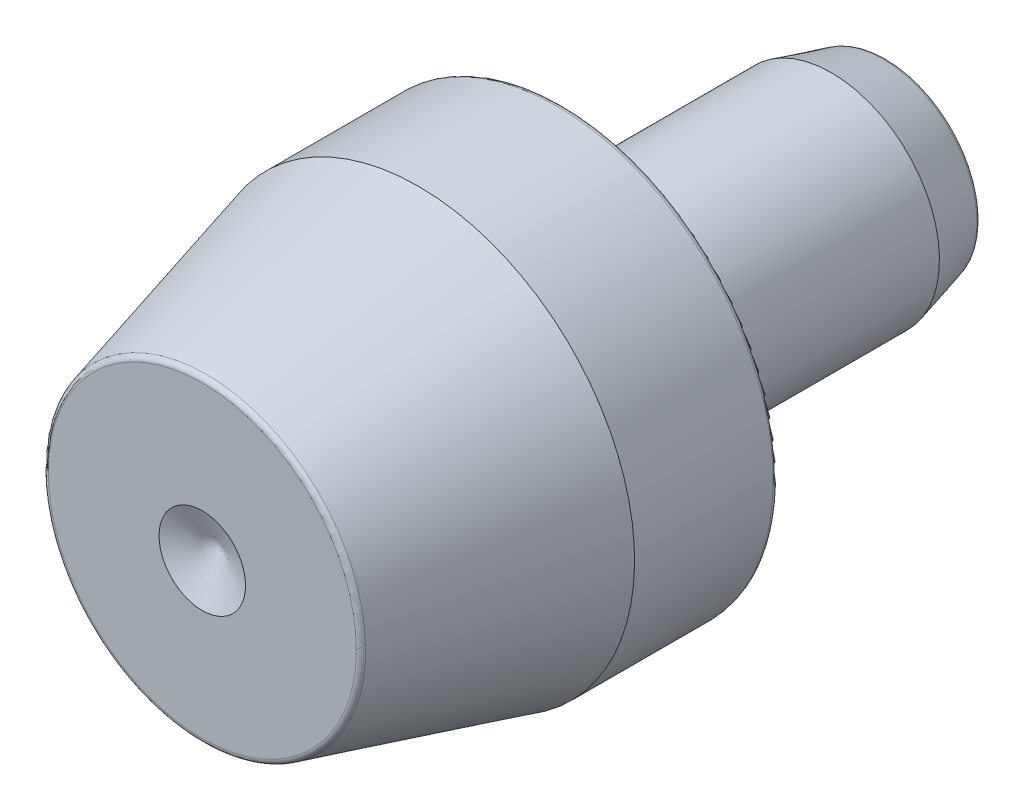
ISO-10303-21;
HEADER;
FILE_DESCRIPTION(('STEP AP214'),'2;1');
FILE_NAME('part.step','',(''),(''),'','','');
FILE_SCHEMA(('AUTOMOTIVE_DESIGN { 1 0 10303 214 1 1 1 1 }'));
ENDSEC;
DATA;
#1=APPLICATION_CONTEXT('core data for automotive mechanical design processes');
#2=APPLICATION_PROTOCOL_DEFINITION('international standard','automotive_design',2000,#1);
#3=PRODUCT_CONTEXT('',#1,'mechanical');
#4=PRODUCT('Part','Part','',(#3));
#5=PRODUCT_RELATED_PRODUCT_CATEGORY('part','',(#4));
#6=PRODUCT_DEFINITION_FORMATION('','',#4);
#7=PRODUCT_DEFINITION_CONTEXT('part definition',#1,'design');
#8=PRODUCT_DEFINITION('design','',#6,#7);
#9=PRODUCT_DEFINITION_SHAPE('','',#8);
#10=(LENGTH_UNIT() NAMED_UNIT(*) SI_UNIT(.MILLI.,.METRE.));
#11=(NAMED_UNIT(*) PLANE_ANGLE_UNIT() SI_UNIT($,.RADIAN.));
#12=(NAMED_UNIT(*) SI_UNIT($,.STERADIAN.) SOLID_ANGLE_UNIT());
#13=UNCERTAINTY_MEASURE_WITH_UNIT(LENGTH_MEASURE(1.E-05),#10,'distance_accuracy_value','');
#14=(GEOMETRIC_REPRESENTATION_CONTEXT(3) GLOBAL_UNCERTAINTY_ASSIGNED_CONTEXT((#13)) GLOBAL_UNIT_ASSIGNED_CONTEXT((#10,
#11,#12)) REPRESENTATION_CONTEXT('',''));
#15=CARTESIAN_POINT('',(0.,0.,0.));
#16=DIRECTION('',(0.,0.,1.));
#17=DIRECTION('',(1.,0.,0.));
#18=AXIS2_PLACEMENT_3D('',#15,#16,#17);
#19=CARTESIAN_POINT('',(0.,0.,9.5));
#20=DIRECTION('',(0.,0.,1.));
#21=DIRECTION('',(0.,-1.,0.));
#22=AXIS2_PLACEMENT_3D('',#19,#20,#21);
#23=CONICAL_SURFACE('',#22,1.2,1.17809724509618);
#24=CARTESIAN_POINT('',(0.,0.,9.0029437251523));
#25=VERTEX_POINT('',#24);
#26=VERTEX_LOOP('',#25);
#27=FACE_BOUND('',#26,.T.);
#28=CARTESIAN_POINT('',(0.,0.,9.5));
#29=DIRECTION('',(0.,0.,-1.));
#30=DIRECTION('',(0.,1.,0.));
#31=AXIS2_PLACEMENT_3D('',#28,#29,#30);
#32=CIRCLE('',#31,1.2);
#33=CARTESIAN_POINT('',(0.,1.2,9.5));
#34=VERTEX_POINT('',#33);
#35=EDGE_CURVE('E12',#34,#34,#32,.T.);
#36=ORIENTED_EDGE('',*,*,#35,.F.);
#37=EDGE_LOOP('',(#36));
#38=FACE_BOUND('',#37,.T.);
#39=ADVANCED_FACE('F184',(#27,#38),#23,.F.);
#40=CARTESIAN_POINT('',(0.,1.2,9.5));
#41=DIRECTION('',(0.,0.,1.));
#42=DIRECTION('',(0.,-1.,0.));
#43=AXIS2_PLACEMENT_3D('',#40,#41,#42);
#44=PLANE('',#43);
#45=ORIENTED_EDGE('',*,*,#35,.T.);
#46=EDGE_LOOP('',(#45));
#47=FACE_BOUND('',#46,.T.);
#48=CARTESIAN_POINT('',(0.,0.,9.5));
#49=DIRECTION('',(0.,0.,-1.));
#50=DIRECTION('',(0.,1.,0.));
#51=AXIS2_PLACEMENT_3D('',#48,#49,#50);
#52=CIRCLE('',#51,4.27432832101149);
#53=CARTESIAN_POINT('',(0.,4.27432832101149,9.5));
#54=VERTEX_POINT('',#53);
#55=EDGE_CURVE('E190',#54,#54,#52,.T.);
#56=ORIENTED_EDGE('',*,*,#55,.F.);
#57=EDGE_LOOP('',(#56));
#58=FACE_BOUND('',#57,.T.);
#59=ADVANCED_FACE('F195',(#47,#58),#44,.T.);
#60=CARTESIAN_POINT('',(0.,0.,9.34625));
#61=DIRECTION('',(0.,0.,-1.));
#62=DIRECTION('',(0.,1.,0.));
#63=AXIS2_PLACEMENT_3D('',#60,#61,#62);
#64=TOROIDAL_SURFACE('',#63,4.27432832101149,0.153750000000001);
#65=ORIENTED_EDGE('',*,*,#55,.T.);
#66=EDGE_LOOP('',(#65));
#67=FACE_BOUND('',#66,.T.);
#68=CARTESIAN_POINT('',(0.,0.,9.38604342818451));
#69=DIRECTION('',(0.,0.,-1.));
#70=DIRECTION('',(0.,1.,0.));
#71=AXIS2_PLACEMENT_3D('',#68,#69,#70);
#72=CIRCLE('',#71,4.42283941680344);
#73=CARTESIAN_POINT('',(0.,4.42283941680344,9.38604342818451));
#74=VERTEX_POINT('',#73);
#75=EDGE_CURVE('E204',#74,#74,#72,.T.);
#76=ORIENTED_EDGE('',*,*,#75,.F.);
#77=EDGE_LOOP('',(#76));
#78=FACE_BOUND('',#77,.T.);
#79=ADVANCED_FACE('F200',(#67,#78),#64,.T.);
#80=CARTESIAN_POINT('',(0.,0.,3.5));
#81=DIRECTION('',(0.,0.,-1.));
#82=DIRECTION('',(0.,1.,0.));
#83=AXIS2_PLACEMENT_3D('',#80,#81,#82);
#84=CONICAL_SURFACE('',#83,6.,0.26179938779915);
#85=ORIENTED_EDGE('',*,*,#75,.T.);
#86=EDGE_LOOP('',(#85));
#87=FACE_BOUND('',#86,.T.);
#88=CARTESIAN_POINT('',(0.,0.,3.5));
#89=DIRECTION('',(0.,0.,-1.));
#90=DIRECTION('',(0.,1.,0.));
#91=AXIS2_PLACEMENT_3D('',#88,#89,#90);
#92=CIRCLE('',#91,6.);
#93=CARTESIAN_POINT('',(0.,6.,3.5));
#94=VERTEX_POINT('',#93);
#95=EDGE_CURVE('E206',#94,#94,#92,.T.);
#96=ORIENTED_EDGE('',*,*,#95,.F.);
#97=EDGE_LOOP('',(#96));
#98=FACE_BOUND('',#97,.T.);
#99=ADVANCED_FACE('F295',(#87,#98),#84,.T.);
#100=CARTESIAN_POINT('',(0.,0.,-9.5));
#101=DIRECTION('',(0.,0.,-1.));
#102=DIRECTION('',(0.,1.,0.));
#103=AXIS2_PLACEMENT_3D('',#100,#101,#102);
#104=CYLINDRICAL_SURFACE('',#103,6.);
#105=ORIENTED_EDGE('',*,*,#95,.T.);
#106=EDGE_LOOP('',(#105));
#107=FACE_BOUND('',#106,.T.);
#108=CARTESIAN_POINT('',(0.,0.,-0.346250000000001));
#109=DIRECTION('',(0.,0.,-1.));
#110=DIRECTION('',(0.,1.,0.));
#111=AXIS2_PLACEMENT_3D('',#108,#109,#110);
#112=CIRCLE('',#111,6.);
#113=CARTESIAN_POINT('',(0.,6.,-0.346250000000001));
#114=VERTEX_POINT('',#113);
#115=EDGE_CURVE('E211',#114,#114,#112,.T.);
#116=ORIENTED_EDGE('',*,*,#115,.F.);
#117=EDGE_LOOP('',(#116));
#118=FACE_BOUND('',#117,.T.);
#119=ADVANCED_FACE('F291',(#107,#118),#104,.T.);
#120=CARTESIAN_POINT('',(0.,0.,-0.34625));
#121=DIRECTION('',(0.,0.,-1.));
#122=DIRECTION('',(0.,1.,0.));
#123=AXIS2_PLACEMENT_3D('',#120,#121,#122);
#124=TOROIDAL_SURFACE('',#123,5.84625,0.15375);
#125=ORIENTED_EDGE('',*,*,#115,.T.);
#126=EDGE_LOOP('',(#125));
#127=FACE_BOUND('',#126,.T.);
#128=CARTESIAN_POINT('',(0.,0.,-0.5));
#129=DIRECTION('',(0.,0.,-1.));
#130=DIRECTION('',(0.,1.,0.));
#131=AXIS2_PLACEMENT_3D('',#128,#129,#130);
#132=CIRCLE('',#131,5.84625);
#133=CARTESIAN_POINT('',(0.,5.84625,-0.5));
#134=VERTEX_POINT('',#133);
#135=EDGE_CURVE('E214',#134,#134,#132,.T.);
#136=ORIENTED_EDGE('',*,*,#135,.F.);
#137=EDGE_LOOP('',(#136));
#138=FACE_BOUND('',#137,.T.);
#139=ADVANCED_FACE('F287',(#127,#138),#124,.T.);
#140=CARTESIAN_POINT('',(0.,5.84625,-0.5));
#141=DIRECTION('',(0.,0.,-1.));
#142=DIRECTION('',(0.,1.,0.));
#143=AXIS2_PLACEMENT_3D('',#140,#141,#142);
#144=PLANE('',#143);
#145=ORIENTED_EDGE('',*,*,#135,.T.);
#146=EDGE_LOOP('',(#145));
#147=FACE_BOUND('',#146,.T.);
#148=CARTESIAN_POINT('',(0.,0.,-0.5));
#149=DIRECTION('',(0.,0.,-1.));
#150=DIRECTION('',(0.,1.,0.));
#151=AXIS2_PLACEMENT_3D('',#148,#149,#150);
#152=CIRCLE('',#151,3.46125);
#153=CARTESIAN_POINT('',(0.,3.46125,-0.5));
#154=VERTEX_POINT('',#153);
#155=EDGE_CURVE('E217',#154,#154,#152,.T.);
#156=ORIENTED_EDGE('',*,*,#155,.F.);
#157=EDGE_LOOP('',(#156));
#158=FACE_BOUND('',#157,.T.);
#159=ADVANCED_FACE('F283',(#147,#158),#144,.T.);
#160=CARTESIAN_POINT('',(0.,0.,-0.5));
#161=DIRECTION('',(0.,0.,-1.));
#162=DIRECTION('',(0.,1.,0.));
#163=AXIS2_PLACEMENT_3D('',#160,#161,#162);
#164=TOROIDAL_SURFACE('',#163,3.3075,0.153750000000001);
#165=ORIENTED_EDGE('',*,*,#155,.T.);
#166=EDGE_LOOP('',(#165));
#167=FACE_BOUND('',#166,.T.);
#168=CARTESIAN_POINT('',(0.,0.,-0.346250000000001));
#169=DIRECTION('',(0.,0.,-1.));
#170=DIRECTION('',(0.,1.,0.));
#171=AXIS2_PLACEMENT_3D('',#168,#169,#170);
#172=CIRCLE('',#171,3.3075);
#173=CARTESIAN_POINT('',(0.,3.3075,-0.346250000000001));
#174=VERTEX_POINT('',#173);
#175=EDGE_CURVE('E220',#174,#174,#172,.T.);
#176=ORIENTED_EDGE('',*,*,#175,.F.);
#177=EDGE_LOOP('',(#176));
#178=FACE_BOUND('',#177,.T.);
#179=ADVANCED_FACE('F279',(#167,#178),#164,.F.);
#180=CARTESIAN_POINT('',(0.,3.3075,-0.346250000000001));
#181=DIRECTION('',(0.,0.,-1.));
#182=DIRECTION('',(0.,1.,0.));
#183=AXIS2_PLACEMENT_3D('',#180,#181,#182);
#184=PLANE('',#183);
#185=ORIENTED_EDGE('',*,*,#175,.T.);
#186=EDGE_LOOP('',(#185));
#187=FACE_BOUND('',#186,.T.);
#188=CARTESIAN_POINT('',(0.,0.,-0.346250000000001));
#189=DIRECTION('',(0.,0.,-1.));
#190=DIRECTION('',(0.,1.,0.));
#191=AXIS2_PLACEMENT_3D('',#188,#189,#190);
#192=CIRCLE('',#191,3.);
#193=CARTESIAN_POINT('',(0.,3.,-0.346250000000001));
#194=VERTEX_POINT('',#193);
#195=EDGE_CURVE('E223',#194,#194,#192,.T.);
#196=ORIENTED_EDGE('',*,*,#195,.F.);
#197=EDGE_LOOP('',(#196));
#198=FACE_BOUND('',#197,.T.);
#199=ADVANCED_FACE('F275',(#187,#198),#184,.T.);
#200=CARTESIAN_POINT('',(0.,0.,-0.500000000000001));
#201=DIRECTION('',(0.,0.,-1.));
#202=DIRECTION('',(0.,1.,0.));
#203=AXIS2_PLACEMENT_3D('',#200,#201,#202);
#204=TOROIDAL_SURFACE('',#203,3.,0.15375);
#205=ORIENTED_EDGE('',*,*,#195,.T.);
#206=EDGE_LOOP('',(#205));
#207=FACE_BOUND('',#206,.T.);
#208=CARTESIAN_POINT('',(0.,0.,-0.5));
#209=DIRECTION('',(0.,0.,-1.));
#210=DIRECTION('',(0.,1.,0.));
#211=AXIS2_PLACEMENT_3D('',#208,#209,#210);
#212=CIRCLE('',#211,2.84625);
#213=CARTESIAN_POINT('',(0.,2.84625,-0.5));
#214=VERTEX_POINT('',#213);
#215=EDGE_CURVE('E226',#214,#214,#212,.T.);
#216=ORIENTED_EDGE('',*,*,#215,.F.);
#217=EDGE_LOOP('',(#216));
#218=FACE_BOUND('',#217,.T.);
#219=ADVANCED_FACE('F271',(#207,#218),#204,.F.);
#220=CARTESIAN_POINT('',(0.,0.,-9.5));
#221=DIRECTION('',(0.,0.,-1.));
#222=DIRECTION('',(0.,1.,0.));
#223=AXIS2_PLACEMENT_3D('',#220,#221,#222);
#224=CYLINDRICAL_SURFACE('',#223,2.84625);
#225=ORIENTED_EDGE('',*,*,#215,.T.);
#226=EDGE_LOOP('',(#225));
#227=FACE_BOUND('',#226,.T.);
#228=CARTESIAN_POINT('',(0.,0.,-1.26875));
#229=DIRECTION('',(0.,0.,-1.));
#230=DIRECTION('',(0.,1.,0.));
#231=AXIS2_PLACEMENT_3D('',#228,#229,#230);
#232=CIRCLE('',#231,2.84625);
#233=CARTESIAN_POINT('',(0.,2.84625,-1.26875));
#234=VERTEX_POINT('',#233);
#235=EDGE_CURVE('E229',#234,#234,#232,.T.);
#236=ORIENTED_EDGE('',*,*,#235,.F.);
#237=EDGE_LOOP('',(#236));
#238=FACE_BOUND('',#237,.T.);
#239=ADVANCED_FACE('F267',(#227,#238),#224,.T.);
#240=CARTESIAN_POINT('',(0.,0.,-1.4225));
#241=DIRECTION('',(0.,0.,-1.));
#242=DIRECTION('',(0.,1.,0.));
#243=AXIS2_PLACEMENT_3D('',#240,#241,#242);
#244=CONICAL_SURFACE('',#243,3.,0.785398163397454);
#245=ORIENTED_EDGE('',*,*,#235,.T.);
#246=EDGE_LOOP('',(#245));
#247=FACE_BOUND('',#246,.T.);
#248=CARTESIAN_POINT('',(0.,0.,-1.4225));
#249=DIRECTION('',(0.,0.,-1.));
#250=DIRECTION('',(0.,1.,0.));
#251=AXIS2_PLACEMENT_3D('',#248,#249,#250);
#252=CIRCLE('',#251,3.);
#253=CARTESIAN_POINT('',(0.,3.,-1.4225));
#254=VERTEX_POINT('',#253);
#255=EDGE_CURVE('E232',#254,#254,#252,.T.);
#256=ORIENTED_EDGE('',*,*,#255,.F.);
#257=EDGE_LOOP('',(#256));
#258=FACE_BOUND('',#257,.T.);
#259=ADVANCED_FACE('F263',(#247,#258),#244,.T.);
#260=CARTESIAN_POINT('',(0.,0.,-9.5));
#261=DIRECTION('',(0.,0.,-1.));
#262=DIRECTION('',(0.,1.,0.));
#263=AXIS2_PLACEMENT_3D('',#260,#261,#262);
#264=CYLINDRICAL_SURFACE('',#263,3.);
#265=ORIENTED_EDGE('',*,*,#255,.T.);
#266=EDGE_LOOP('',(#265));
#267=FACE_BOUND('',#266,.T.);
#268=CARTESIAN_POINT('',(0.,0.,-7.9625));
#269=DIRECTION('',(0.,0.,-1.));
#270=DIRECTION('',(0.,1.,0.));
#271=AXIS2_PLACEMENT_3D('',#268,#269,#270);
#272=CIRCLE('',#271,3.);
#273=CARTESIAN_POINT('',(0.,3.,-7.9625));
#274=VERTEX_POINT('',#273);
#275=EDGE_CURVE('E235',#274,#274,#272,.T.);
#276=ORIENTED_EDGE('',*,*,#275,.F.);
#277=EDGE_LOOP('',(#276));
#278=FACE_BOUND('',#277,.T.);
#279=ADVANCED_FACE('F257',(#267,#278),#264,.T.);
#280=CARTESIAN_POINT('',(0.,0.,-9.38604342818451));
#281=DIRECTION('',(0.,0.,1.));
#282=DIRECTION('',(0.,-1.,0.));
#283=AXIS2_PLACEMENT_3D('',#280,#281,#282);
#284=CONICAL_SURFACE('',#283,2.61856268802733,0.26179938779915);
#285=ORIENTED_EDGE('',*,*,#275,.T.);
#286=EDGE_LOOP('',(#285));
#287=FACE_BOUND('',#286,.T.);
#288=CARTESIAN_POINT('',(0.,0.,-9.38604342818451));
#289=DIRECTION('',(0.,0.,-1.));
#290=DIRECTION('',(0.,1.,0.));
#291=AXIS2_PLACEMENT_3D('',#288,#289,#290);
#292=CIRCLE('',#291,2.61856268802733);
#293=CARTESIAN_POINT('',(0.,2.61856268802733,-9.38604342818451));
#294=VERTEX_POINT('',#293);
#295=EDGE_CURVE('E238',#294,#294,#292,.T.);
#296=ORIENTED_EDGE('',*,*,#295,.F.);
#297=EDGE_LOOP('',(#296));
#298=FACE_BOUND('',#297,.T.);
#299=ADVANCED_FACE('F249',(#287,#298),#284,.T.);
#300=CARTESIAN_POINT('',(0.,0.,-9.34625));
#301=DIRECTION('',(0.,0.,-1.));
#302=DIRECTION('',(0.,1.,0.));
#303=AXIS2_PLACEMENT_3D('',#300,#301,#302);
#304=TOROIDAL_SURFACE('',#303,2.47005159223538,0.15375);
#305=ORIENTED_EDGE('',*,*,#295,.T.);
#306=EDGE_LOOP('',(#305));
#307=FACE_BOUND('',#306,.T.);
#308=CARTESIAN_POINT('',(0.,0.,-9.5));
#309=DIRECTION('',(0.,0.,-1.));
#310=DIRECTION('',(0.,1.,0.));
#311=AXIS2_PLACEMENT_3D('',#308,#309,#310);
#312=CIRCLE('',#311,2.47005159223538);
#313=CARTESIAN_POINT('',(0.,2.47005159223538,-9.5));
#314=VERTEX_POINT('',#313);
#315=EDGE_CURVE('E241',#314,#314,#312,.T.);
#316=ORIENTED_EDGE('',*,*,#315,.F.);
#317=EDGE_LOOP('',(#316));
#318=FACE_BOUND('',#317,.T.);
#319=ADVANCED_FACE('F247',(#307,#318),#304,.T.);
#320=CARTESIAN_POINT('',(0.,2.47005159223538,-9.5));
#321=DIRECTION('',(0.,0.,-1.));
#322=DIRECTION('',(0.,1.,0.));
#323=AXIS2_PLACEMENT_3D('',#320,#321,#322);
#324=PLANE('',#323);
#325=ORIENTED_EDGE('',*,*,#315,.T.);
#326=EDGE_LOOP('',(#325));
#327=FACE_BOUND('',#326,.T.);
#328=ADVANCED_FACE('F245',(#327),#324,.T.);
#329=CLOSED_SHELL('',(#39,#59,#79,#99,#119,#139,#159,#179,#199,#219,#239,#259,#279,#299,#319,#328));
#330=MANIFOLD_SOLID_BREP('B2',#329);
#331=ADVANCED_BREP_SHAPE_REPRESENTATION('',(#18,#330),#14);
#332=SHAPE_DEFINITION_REPRESENTATION(#9,#331);
ENDSEC;
END-ISO-10303-21;
